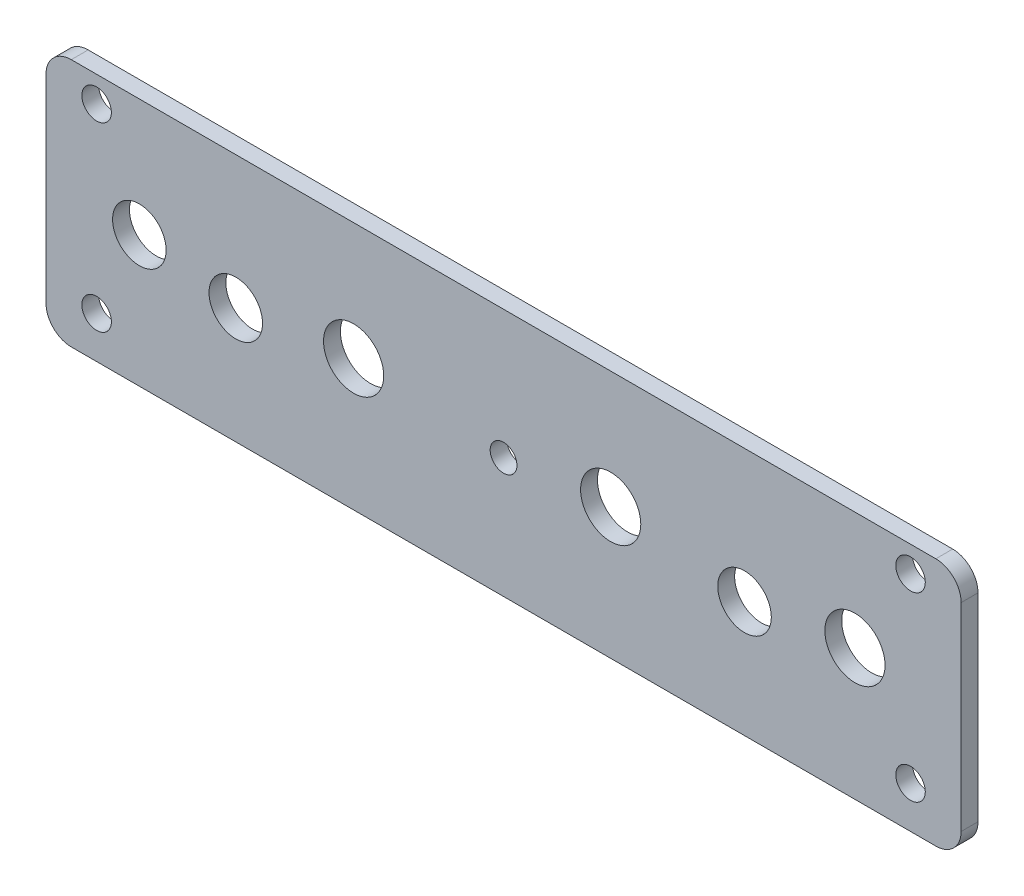
ISO-10303-21;
HEADER;
FILE_DESCRIPTION(('STEP AP214'),'2;1');
FILE_NAME('part.step','',(''),(''),'','','');
FILE_SCHEMA(('AUTOMOTIVE_DESIGN { 1 0 10303 214 1 1 1 1 }'));
ENDSEC;
DATA;
#1=APPLICATION_CONTEXT('core data for automotive mechanical design processes');
#2=APPLICATION_PROTOCOL_DEFINITION('international standard','automotive_design',2000,#1);
#3=PRODUCT_CONTEXT('',#1,'mechanical');
#4=PRODUCT('Part','Part','',(#3));
#5=PRODUCT_RELATED_PRODUCT_CATEGORY('part','',(#4));
#6=PRODUCT_DEFINITION_FORMATION('','',#4);
#7=PRODUCT_DEFINITION_CONTEXT('part definition',#1,'design');
#8=PRODUCT_DEFINITION('design','',#6,#7);
#9=PRODUCT_DEFINITION_SHAPE('','',#8);
#10=(LENGTH_UNIT() NAMED_UNIT(*) SI_UNIT(.MILLI.,.METRE.));
#11=(NAMED_UNIT(*) PLANE_ANGLE_UNIT() SI_UNIT($,.RADIAN.));
#12=(NAMED_UNIT(*) SI_UNIT($,.STERADIAN.) SOLID_ANGLE_UNIT());
#13=UNCERTAINTY_MEASURE_WITH_UNIT(LENGTH_MEASURE(1.E-05),#10,'distance_accuracy_value','');
#14=(GEOMETRIC_REPRESENTATION_CONTEXT(3) GLOBAL_UNCERTAINTY_ASSIGNED_CONTEXT((#13)) GLOBAL_UNIT_ASSIGNED_CONTEXT((#10,
#11,#12)) REPRESENTATION_CONTEXT('',''));
#15=CARTESIAN_POINT('',(0.,0.,0.));
#16=DIRECTION('',(0.,0.,1.));
#17=DIRECTION('',(1.,0.,0.));
#18=AXIS2_PLACEMENT_3D('',#15,#16,#17);
#19=CARTESIAN_POINT('',(51.25,-11.75,2.));
#20=DIRECTION('',(0.,0.,1.));
#21=DIRECTION('',(1.,0.,0.));
#22=AXIS2_PLACEMENT_3D('',#19,#20,#21);
#23=PLANE('',#22);
#24=CARTESIAN_POINT('',(-48.25,11.7,2.));
#25=DIRECTION('',(0.,0.,1.));
#26=DIRECTION('',(1.,0.,0.));
#27=AXIS2_PLACEMENT_3D('',#24,#25,#26);
#28=CIRCLE('',#27,1.75);
#29=CARTESIAN_POINT('',(-46.5,11.7,2.));
#30=VERTEX_POINT('',#29);
#31=EDGE_CURVE('E234',#30,#30,#28,.T.);
#32=ORIENTED_EDGE('',*,*,#31,.F.);
#33=EDGE_LOOP('',(#32));
#34=FACE_BOUND('',#33,.T.);
#35=CARTESIAN_POINT('',(48.25,11.7,2.));
#36=DIRECTION('',(0.,0.,1.));
#37=DIRECTION('',(1.,0.,0.));
#38=AXIS2_PLACEMENT_3D('',#35,#36,#37);
#39=CIRCLE('',#38,1.75);
#40=CARTESIAN_POINT('',(50.,11.7,2.));
#41=VERTEX_POINT('',#40);
#42=EDGE_CURVE('E222',#41,#41,#39,.T.);
#43=ORIENTED_EDGE('',*,*,#42,.F.);
#44=EDGE_LOOP('',(#43));
#45=FACE_BOUND('',#44,.T.);
#46=CARTESIAN_POINT('',(28.57,-1.,2.));
#47=DIRECTION('',(0.,0.,1.));
#48=DIRECTION('',(1.,0.,0.));
#49=AXIS2_PLACEMENT_3D('',#46,#47,#48);
#50=CIRCLE('',#49,3.175);
#51=CARTESIAN_POINT('',(31.745,-1.,2.));
#52=VERTEX_POINT('',#51);
#53=EDGE_CURVE('E210',#52,#52,#50,.T.);
#54=ORIENTED_EDGE('',*,*,#53,.F.);
#55=EDGE_LOOP('',(#54));
#56=FACE_BOUND('',#55,.T.);
#57=CARTESIAN_POINT('',(-43.18,0.8,2.));
#58=DIRECTION('',(0.,0.,1.));
#59=DIRECTION('',(1.,0.,0.));
#60=AXIS2_PLACEMENT_3D('',#57,#58,#59);
#61=CIRCLE('',#60,3.175);
#62=CARTESIAN_POINT('',(-40.005,0.8,2.));
#63=VERTEX_POINT('',#62);
#64=EDGE_CURVE('E198',#63,#63,#61,.T.);
#65=ORIENTED_EDGE('',*,*,#64,.F.);
#66=EDGE_LOOP('',(#65));
#67=FACE_BOUND('',#66,.T.);
#68=CARTESIAN_POINT('',(-17.78,0.8,2.));
#69=DIRECTION('',(0.,0.,1.));
#70=DIRECTION('',(1.,0.,0.));
#71=AXIS2_PLACEMENT_3D('',#68,#69,#70);
#72=CIRCLE('',#71,3.5687);
#73=CARTESIAN_POINT('',(-14.2113,0.8,2.));
#74=VERTEX_POINT('',#73);
#75=EDGE_CURVE('E186',#74,#74,#72,.T.);
#76=ORIENTED_EDGE('',*,*,#75,.F.);
#77=EDGE_LOOP('',(#76));
#78=FACE_BOUND('',#77,.T.);
#79=CARTESIAN_POINT('',(51.25,-11.75,2.));
#80=DIRECTION('',(0.,0.,1.));
#81=DIRECTION('',(1.,0.,0.));
#82=AXIS2_PLACEMENT_3D('',#79,#80,#81);
#83=CIRCLE('',#82,3.);
#84=CARTESIAN_POINT('',(51.25,-14.75,2.));
#85=VERTEX_POINT('',#84);
#86=CARTESIAN_POINT('',(54.25,-11.75,2.));
#87=VERTEX_POINT('',#86);
#88=EDGE_CURVE('E149',#85,#87,#83,.T.);
#89=ORIENTED_EDGE('',*,*,#88,.T.);
#90=DIRECTION('',(0.,1.,0.));
#91=VECTOR('',#90,1.);
#92=CARTESIAN_POINT('',(54.25,-11.75,2.));
#93=LINE('',#92,#91);
#94=CARTESIAN_POINT('',(54.25,11.75,2.));
#95=VERTEX_POINT('',#94);
#96=EDGE_CURVE('E97',#87,#95,#93,.T.);
#97=ORIENTED_EDGE('',*,*,#96,.T.);
#98=CARTESIAN_POINT('',(51.25,11.75,2.));
#99=DIRECTION('',(0.,0.,1.));
#100=DIRECTION('',(1.,0.,0.));
#101=AXIS2_PLACEMENT_3D('',#98,#99,#100);
#102=CIRCLE('',#101,3.);
#103=CARTESIAN_POINT('',(51.25,14.75,2.));
#104=VERTEX_POINT('',#103);
#105=EDGE_CURVE('E164',#95,#104,#102,.T.);
#106=ORIENTED_EDGE('',*,*,#105,.T.);
#107=DIRECTION('',(-1.,0.,0.));
#108=VECTOR('',#107,1.);
#109=CARTESIAN_POINT('',(51.25,14.75,2.));
#110=LINE('',#109,#108);
#111=CARTESIAN_POINT('',(-51.25,14.75,2.));
#112=VERTEX_POINT('',#111);
#113=EDGE_CURVE('E177',#104,#112,#110,.T.);
#114=ORIENTED_EDGE('',*,*,#113,.T.);
#115=CARTESIAN_POINT('',(-51.25,11.75,2.));
#116=DIRECTION('',(0.,0.,1.));
#117=DIRECTION('',(1.,0.,0.));
#118=AXIS2_PLACEMENT_3D('',#115,#116,#117);
#119=CIRCLE('',#118,3.);
#120=CARTESIAN_POINT('',(-54.25,11.75,2.));
#121=VERTEX_POINT('',#120);
#122=EDGE_CURVE('E116',#112,#121,#119,.T.);
#123=ORIENTED_EDGE('',*,*,#122,.T.);
#124=DIRECTION('',(0.,-1.,0.));
#125=VECTOR('',#124,1.);
#126=CARTESIAN_POINT('',(-54.25,-11.75,2.));
#127=LINE('',#126,#125);
#128=CARTESIAN_POINT('',(-54.25,-11.75,2.));
#129=VERTEX_POINT('',#128);
#130=EDGE_CURVE('E110',#121,#129,#127,.T.);
#131=ORIENTED_EDGE('',*,*,#130,.T.);
#132=CARTESIAN_POINT('',(-51.25,-11.75,2.));
#133=DIRECTION('',(0.,0.,1.));
#134=DIRECTION('',(-1.,0.,0.));
#135=AXIS2_PLACEMENT_3D('',#132,#133,#134);
#136=CIRCLE('',#135,3.);
#137=CARTESIAN_POINT('',(-51.25,-14.75,2.));
#138=VERTEX_POINT('',#137);
#139=EDGE_CURVE('E114',#129,#138,#136,.T.);
#140=ORIENTED_EDGE('',*,*,#139,.T.);
#141=DIRECTION('',(1.,0.,0.));
#142=VECTOR('',#141,1.);
#143=CARTESIAN_POINT('',(51.25,-14.75,2.));
#144=LINE('',#143,#142);
#145=EDGE_CURVE('E54',#138,#85,#144,.T.);
#146=ORIENTED_EDGE('',*,*,#145,.T.);
#147=EDGE_LOOP('',(#89,#97,#106,#114,#123,#131,#140,#146));
#148=FACE_BOUND('',#147,.T.);
#149=CARTESIAN_POINT('',(0.,-0.5,2.));
#150=DIRECTION('',(0.,0.,1.));
#151=DIRECTION('',(1.,0.,0.));
#152=AXIS2_PLACEMENT_3D('',#149,#150,#151);
#153=CIRCLE('',#152,1.5875);
#154=CARTESIAN_POINT('',(1.5875,-0.5,2.));
#155=VERTEX_POINT('',#154);
#156=EDGE_CURVE('E138',#155,#155,#153,.T.);
#157=ORIENTED_EDGE('',*,*,#156,.F.);
#158=EDGE_LOOP('',(#157));
#159=FACE_BOUND('',#158,.T.);
#160=CARTESIAN_POINT('',(-31.75,-1.,2.));
#161=DIRECTION('',(0.,0.,1.));
#162=DIRECTION('',(1.,0.,0.));
#163=AXIS2_PLACEMENT_3D('',#160,#161,#162);
#164=CIRCLE('',#163,3.175);
#165=CARTESIAN_POINT('',(-28.575,-1.,2.));
#166=VERTEX_POINT('',#165);
#167=EDGE_CURVE('E192',#166,#166,#164,.T.);
#168=ORIENTED_EDGE('',*,*,#167,.F.);
#169=EDGE_LOOP('',(#168));
#170=FACE_BOUND('',#169,.T.);
#171=CARTESIAN_POINT('',(12.7,0.8,2.));
#172=DIRECTION('',(0.,0.,1.));
#173=DIRECTION('',(1.,0.,0.));
#174=AXIS2_PLACEMENT_3D('',#171,#172,#173);
#175=CIRCLE('',#174,3.5687);
#176=CARTESIAN_POINT('',(16.2687,0.8,2.));
#177=VERTEX_POINT('',#176);
#178=EDGE_CURVE('E204',#177,#177,#175,.T.);
#179=ORIENTED_EDGE('',*,*,#178,.F.);
#180=EDGE_LOOP('',(#179));
#181=FACE_BOUND('',#180,.T.);
#182=CARTESIAN_POINT('',(41.66,0.8,2.));
#183=DIRECTION('',(0.,0.,1.));
#184=DIRECTION('',(1.,0.,0.));
#185=AXIS2_PLACEMENT_3D('',#182,#183,#184);
#186=CIRCLE('',#185,3.5687);
#187=CARTESIAN_POINT('',(45.2287,0.8,2.));
#188=VERTEX_POINT('',#187);
#189=EDGE_CURVE('E216',#188,#188,#186,.T.);
#190=ORIENTED_EDGE('',*,*,#189,.F.);
#191=EDGE_LOOP('',(#190));
#192=FACE_BOUND('',#191,.T.);
#193=CARTESIAN_POINT('',(48.25,-9.8,2.));
#194=DIRECTION('',(0.,0.,1.));
#195=DIRECTION('',(1.,0.,0.));
#196=AXIS2_PLACEMENT_3D('',#193,#194,#195);
#197=CIRCLE('',#196,1.75);
#198=CARTESIAN_POINT('',(50.,-9.8,2.));
#199=VERTEX_POINT('',#198);
#200=EDGE_CURVE('E228',#199,#199,#197,.T.);
#201=ORIENTED_EDGE('',*,*,#200,.F.);
#202=EDGE_LOOP('',(#201));
#203=FACE_BOUND('',#202,.T.);
#204=CARTESIAN_POINT('',(-48.25,-9.8,2.));
#205=DIRECTION('',(0.,0.,1.));
#206=DIRECTION('',(1.,0.,0.));
#207=AXIS2_PLACEMENT_3D('',#204,#205,#206);
#208=CIRCLE('',#207,1.75);
#209=CARTESIAN_POINT('',(-46.5,-9.8,2.));
#210=VERTEX_POINT('',#209);
#211=EDGE_CURVE('E240',#210,#210,#208,.T.);
#212=ORIENTED_EDGE('',*,*,#211,.F.);
#213=EDGE_LOOP('',(#212));
#214=FACE_BOUND('',#213,.T.);
#215=ADVANCED_FACE('F37',(#34,#45,#56,#67,#78,#148,#159,#170,#181,#192,#203,#214),#23,.T.);
#216=CARTESIAN_POINT('',(51.25,-11.75,0.));
#217=DIRECTION('',(0.,0.,1.));
#218=DIRECTION('',(1.,0.,0.));
#219=AXIS2_PLACEMENT_3D('',#216,#217,#218);
#220=PLANE('',#219);
#221=CARTESIAN_POINT('',(51.25,-11.75,0.));
#222=DIRECTION('',(0.,0.,1.));
#223=DIRECTION('',(1.,0.,0.));
#224=AXIS2_PLACEMENT_3D('',#221,#222,#223);
#225=CIRCLE('',#224,3.);
#226=CARTESIAN_POINT('',(51.25,-14.75,0.));
#227=VERTEX_POINT('',#226);
#228=CARTESIAN_POINT('',(54.25,-11.75,0.));
#229=VERTEX_POINT('',#228);
#230=EDGE_CURVE('E134',#227,#229,#225,.T.);
#231=ORIENTED_EDGE('',*,*,#230,.F.);
#232=DIRECTION('',(1.,0.,0.));
#233=VECTOR('',#232,1.);
#234=CARTESIAN_POINT('',(51.25,-14.75,0.));
#235=LINE('',#234,#233);
#236=CARTESIAN_POINT('',(-51.25,-14.75,0.));
#237=VERTEX_POINT('',#236);
#238=EDGE_CURVE('E89',#237,#227,#235,.T.);
#239=ORIENTED_EDGE('',*,*,#238,.F.);
#240=CARTESIAN_POINT('',(-51.25,-11.75,0.));
#241=DIRECTION('',(0.,0.,1.));
#242=DIRECTION('',(-1.,0.,0.));
#243=AXIS2_PLACEMENT_3D('',#240,#241,#242);
#244=CIRCLE('',#243,3.);
#245=CARTESIAN_POINT('',(-54.25,-11.75,0.));
#246=VERTEX_POINT('',#245);
#247=EDGE_CURVE('E83',#246,#237,#244,.T.);
#248=ORIENTED_EDGE('',*,*,#247,.F.);
#249=DIRECTION('',(0.,-1.,0.));
#250=VECTOR('',#249,1.);
#251=CARTESIAN_POINT('',(-54.25,-11.75,0.));
#252=LINE('',#251,#250);
#253=CARTESIAN_POINT('',(-54.25,11.75,0.));
#254=VERTEX_POINT('',#253);
#255=EDGE_CURVE('E124',#254,#246,#252,.T.);
#256=ORIENTED_EDGE('',*,*,#255,.F.);
#257=CARTESIAN_POINT('',(-51.25,11.75,0.));
#258=DIRECTION('',(0.,0.,1.));
#259=DIRECTION('',(1.,0.,0.));
#260=AXIS2_PLACEMENT_3D('',#257,#258,#259);
#261=CIRCLE('',#260,3.);
#262=CARTESIAN_POINT('',(-51.25,14.75,0.));
#263=VERTEX_POINT('',#262);
#264=EDGE_CURVE('E144',#263,#254,#261,.T.);
#265=ORIENTED_EDGE('',*,*,#264,.F.);
#266=DIRECTION('',(-1.,0.,0.));
#267=VECTOR('',#266,1.);
#268=CARTESIAN_POINT('',(51.25,14.75,0.));
#269=LINE('',#268,#267);
#270=CARTESIAN_POINT('',(51.25,14.75,0.));
#271=VERTEX_POINT('',#270);
#272=EDGE_CURVE('E142',#271,#263,#269,.T.);
#273=ORIENTED_EDGE('',*,*,#272,.F.);
#274=CARTESIAN_POINT('',(51.25,11.75,0.));
#275=DIRECTION('',(0.,0.,1.));
#276=DIRECTION('',(1.,0.,0.));
#277=AXIS2_PLACEMENT_3D('',#274,#275,#276);
#278=CIRCLE('',#277,3.);
#279=CARTESIAN_POINT('',(54.25,11.75,0.));
#280=VERTEX_POINT('',#279);
#281=EDGE_CURVE('E140',#280,#271,#278,.T.);
#282=ORIENTED_EDGE('',*,*,#281,.F.);
#283=DIRECTION('',(0.,1.,0.));
#284=VECTOR('',#283,1.);
#285=CARTESIAN_POINT('',(54.25,-11.75,0.));
#286=LINE('',#285,#284);
#287=EDGE_CURVE('E137',#229,#280,#286,.T.);
#288=ORIENTED_EDGE('',*,*,#287,.F.);
#289=EDGE_LOOP('',(#231,#239,#248,#256,#265,#273,#282,#288));
#290=FACE_BOUND('',#289,.T.);
#291=CARTESIAN_POINT('',(0.,-0.5,0.));
#292=DIRECTION('',(0.,0.,1.));
#293=DIRECTION('',(1.,0.,0.));
#294=AXIS2_PLACEMENT_3D('',#291,#292,#293);
#295=CIRCLE('',#294,1.5875);
#296=CARTESIAN_POINT('',(1.5875,-0.5,0.));
#297=VERTEX_POINT('',#296);
#298=EDGE_CURVE('E183',#297,#297,#295,.T.);
#299=ORIENTED_EDGE('',*,*,#298,.T.);
#300=EDGE_LOOP('',(#299));
#301=FACE_BOUND('',#300,.T.);
#302=CARTESIAN_POINT('',(-17.78,0.8,0.));
#303=DIRECTION('',(0.,0.,1.));
#304=DIRECTION('',(1.,0.,0.));
#305=AXIS2_PLACEMENT_3D('',#302,#303,#304);
#306=CIRCLE('',#305,3.5687);
#307=CARTESIAN_POINT('',(-14.2113,0.8,0.));
#308=VERTEX_POINT('',#307);
#309=EDGE_CURVE('E189',#308,#308,#306,.T.);
#310=ORIENTED_EDGE('',*,*,#309,.T.);
#311=EDGE_LOOP('',(#310));
#312=FACE_BOUND('',#311,.T.);
#313=CARTESIAN_POINT('',(-31.75,-1.,0.));
#314=DIRECTION('',(0.,0.,1.));
#315=DIRECTION('',(1.,0.,0.));
#316=AXIS2_PLACEMENT_3D('',#313,#314,#315);
#317=CIRCLE('',#316,3.175);
#318=CARTESIAN_POINT('',(-28.575,-1.,0.));
#319=VERTEX_POINT('',#318);
#320=EDGE_CURVE('E195',#319,#319,#317,.T.);
#321=ORIENTED_EDGE('',*,*,#320,.T.);
#322=EDGE_LOOP('',(#321));
#323=FACE_BOUND('',#322,.T.);
#324=CARTESIAN_POINT('',(-43.18,0.8,0.));
#325=DIRECTION('',(0.,0.,1.));
#326=DIRECTION('',(1.,0.,0.));
#327=AXIS2_PLACEMENT_3D('',#324,#325,#326);
#328=CIRCLE('',#327,3.175);
#329=CARTESIAN_POINT('',(-40.005,0.8,0.));
#330=VERTEX_POINT('',#329);
#331=EDGE_CURVE('E201',#330,#330,#328,.T.);
#332=ORIENTED_EDGE('',*,*,#331,.T.);
#333=EDGE_LOOP('',(#332));
#334=FACE_BOUND('',#333,.T.);
#335=CARTESIAN_POINT('',(12.7,0.8,0.));
#336=DIRECTION('',(0.,0.,1.));
#337=DIRECTION('',(1.,0.,0.));
#338=AXIS2_PLACEMENT_3D('',#335,#336,#337);
#339=CIRCLE('',#338,3.5687);
#340=CARTESIAN_POINT('',(16.2687,0.8,0.));
#341=VERTEX_POINT('',#340);
#342=EDGE_CURVE('E207',#341,#341,#339,.T.);
#343=ORIENTED_EDGE('',*,*,#342,.T.);
#344=EDGE_LOOP('',(#343));
#345=FACE_BOUND('',#344,.T.);
#346=CARTESIAN_POINT('',(28.57,-1.,0.));
#347=DIRECTION('',(0.,0.,1.));
#348=DIRECTION('',(1.,0.,0.));
#349=AXIS2_PLACEMENT_3D('',#346,#347,#348);
#350=CIRCLE('',#349,3.175);
#351=CARTESIAN_POINT('',(31.745,-1.,0.));
#352=VERTEX_POINT('',#351);
#353=EDGE_CURVE('E213',#352,#352,#350,.T.);
#354=ORIENTED_EDGE('',*,*,#353,.T.);
#355=EDGE_LOOP('',(#354));
#356=FACE_BOUND('',#355,.T.);
#357=CARTESIAN_POINT('',(41.66,0.8,0.));
#358=DIRECTION('',(0.,0.,1.));
#359=DIRECTION('',(1.,0.,0.));
#360=AXIS2_PLACEMENT_3D('',#357,#358,#359);
#361=CIRCLE('',#360,3.5687);
#362=CARTESIAN_POINT('',(45.2287,0.8,0.));
#363=VERTEX_POINT('',#362);
#364=EDGE_CURVE('E219',#363,#363,#361,.T.);
#365=ORIENTED_EDGE('',*,*,#364,.T.);
#366=EDGE_LOOP('',(#365));
#367=FACE_BOUND('',#366,.T.);
#368=CARTESIAN_POINT('',(48.25,11.7,0.));
#369=DIRECTION('',(0.,0.,1.));
#370=DIRECTION('',(1.,0.,0.));
#371=AXIS2_PLACEMENT_3D('',#368,#369,#370);
#372=CIRCLE('',#371,1.75);
#373=CARTESIAN_POINT('',(50.,11.7,0.));
#374=VERTEX_POINT('',#373);
#375=EDGE_CURVE('E225',#374,#374,#372,.T.);
#376=ORIENTED_EDGE('',*,*,#375,.T.);
#377=EDGE_LOOP('',(#376));
#378=FACE_BOUND('',#377,.T.);
#379=CARTESIAN_POINT('',(48.25,-9.8,0.));
#380=DIRECTION('',(0.,0.,1.));
#381=DIRECTION('',(1.,0.,0.));
#382=AXIS2_PLACEMENT_3D('',#379,#380,#381);
#383=CIRCLE('',#382,1.75);
#384=CARTESIAN_POINT('',(50.,-9.8,0.));
#385=VERTEX_POINT('',#384);
#386=EDGE_CURVE('E231',#385,#385,#383,.T.);
#387=ORIENTED_EDGE('',*,*,#386,.T.);
#388=EDGE_LOOP('',(#387));
#389=FACE_BOUND('',#388,.T.);
#390=CARTESIAN_POINT('',(-48.25,11.7,0.));
#391=DIRECTION('',(0.,0.,1.));
#392=DIRECTION('',(1.,0.,0.));
#393=AXIS2_PLACEMENT_3D('',#390,#391,#392);
#394=CIRCLE('',#393,1.75);
#395=CARTESIAN_POINT('',(-46.5,11.7,0.));
#396=VERTEX_POINT('',#395);
#397=EDGE_CURVE('E237',#396,#396,#394,.T.);
#398=ORIENTED_EDGE('',*,*,#397,.T.);
#399=EDGE_LOOP('',(#398));
#400=FACE_BOUND('',#399,.T.);
#401=CARTESIAN_POINT('',(-48.25,-9.8,0.));
#402=DIRECTION('',(0.,0.,1.));
#403=DIRECTION('',(1.,0.,0.));
#404=AXIS2_PLACEMENT_3D('',#401,#402,#403);
#405=CIRCLE('',#404,1.75);
#406=CARTESIAN_POINT('',(-46.5,-9.8,0.));
#407=VERTEX_POINT('',#406);
#408=EDGE_CURVE('E243',#407,#407,#405,.T.);
#409=ORIENTED_EDGE('',*,*,#408,.T.);
#410=EDGE_LOOP('',(#409));
#411=FACE_BOUND('',#410,.T.);
#412=ADVANCED_FACE('F168',(#290,#301,#312,#323,#334,#345,#356,#367,#378,#389,#400,#411),#220,.F.);
#413=CARTESIAN_POINT('',(51.25,-11.75,2.));
#414=DIRECTION('',(0.,0.,-1.));
#415=DIRECTION('',(-1.,0.,0.));
#416=AXIS2_PLACEMENT_3D('',#413,#414,#415);
#417=CYLINDRICAL_SURFACE('',#416,3.);
#418=ORIENTED_EDGE('',*,*,#230,.T.);
#419=DIRECTION('',(0.,0.,-1.));
#420=VECTOR('',#419,1.);
#421=CARTESIAN_POINT('',(54.25,-11.75,2.));
#422=LINE('',#421,#420);
#423=EDGE_CURVE('E11',#87,#229,#422,.T.);
#424=ORIENTED_EDGE('',*,*,#423,.F.);
#425=ORIENTED_EDGE('',*,*,#88,.F.);
#426=DIRECTION('',(0.,0.,-1.));
#427=VECTOR('',#426,1.);
#428=CARTESIAN_POINT('',(51.25,-14.75,2.));
#429=LINE('',#428,#427);
#430=EDGE_CURVE('E130',#85,#227,#429,.T.);
#431=ORIENTED_EDGE('',*,*,#430,.T.);
#432=EDGE_LOOP('',(#418,#424,#425,#431));
#433=FACE_BOUND('',#432,.T.);
#434=ADVANCED_FACE('F39',(#433),#417,.T.);
#435=CARTESIAN_POINT('',(54.25,-11.75,2.));
#436=DIRECTION('',(-1.,0.,0.));
#437=DIRECTION('',(0.,0.,1.));
#438=AXIS2_PLACEMENT_3D('',#435,#436,#437);
#439=PLANE('',#438);
#440=ORIENTED_EDGE('',*,*,#287,.T.);
#441=DIRECTION('',(0.,0.,-1.));
#442=VECTOR('',#441,1.);
#443=CARTESIAN_POINT('',(54.25,11.75,2.));
#444=LINE('',#443,#442);
#445=EDGE_CURVE('E46',#95,#280,#444,.T.);
#446=ORIENTED_EDGE('',*,*,#445,.F.);
#447=ORIENTED_EDGE('',*,*,#96,.F.);
#448=ORIENTED_EDGE('',*,*,#423,.T.);
#449=EDGE_LOOP('',(#440,#446,#447,#448));
#450=FACE_BOUND('',#449,.T.);
#451=ADVANCED_FACE('F277',(#450),#439,.F.);
#452=CARTESIAN_POINT('',(51.25,11.75,2.));
#453=DIRECTION('',(0.,0.,-1.));
#454=DIRECTION('',(-1.,0.,0.));
#455=AXIS2_PLACEMENT_3D('',#452,#453,#454);
#456=CYLINDRICAL_SURFACE('',#455,3.);
#457=ORIENTED_EDGE('',*,*,#281,.T.);
#458=DIRECTION('',(0.,0.,-1.));
#459=VECTOR('',#458,1.);
#460=CARTESIAN_POINT('',(51.25,14.75,2.));
#461=LINE('',#460,#459);
#462=EDGE_CURVE('E156',#104,#271,#461,.T.);
#463=ORIENTED_EDGE('',*,*,#462,.F.);
#464=ORIENTED_EDGE('',*,*,#105,.F.);
#465=ORIENTED_EDGE('',*,*,#445,.T.);
#466=EDGE_LOOP('',(#457,#463,#464,#465));
#467=FACE_BOUND('',#466,.T.);
#468=ADVANCED_FACE('F162',(#467),#456,.T.);
#469=CARTESIAN_POINT('',(51.25,14.75,2.));
#470=DIRECTION('',(0.,-1.,0.));
#471=DIRECTION('',(1.,0.,0.));
#472=AXIS2_PLACEMENT_3D('',#469,#470,#471);
#473=PLANE('',#472);
#474=ORIENTED_EDGE('',*,*,#272,.T.);
#475=DIRECTION('',(0.,0.,-1.));
#476=VECTOR('',#475,1.);
#477=CARTESIAN_POINT('',(-51.25,14.75,2.));
#478=LINE('',#477,#476);
#479=EDGE_CURVE('E153',#112,#263,#478,.T.);
#480=ORIENTED_EDGE('',*,*,#479,.F.);
#481=ORIENTED_EDGE('',*,*,#113,.F.);
#482=ORIENTED_EDGE('',*,*,#462,.T.);
#483=EDGE_LOOP('',(#474,#480,#481,#482));
#484=FACE_BOUND('',#483,.T.);
#485=ADVANCED_FACE('F173',(#484),#473,.F.);
#486=CARTESIAN_POINT('',(-51.25,11.75,2.));
#487=DIRECTION('',(0.,0.,-1.));
#488=DIRECTION('',(-1.,0.,0.));
#489=AXIS2_PLACEMENT_3D('',#486,#487,#488);
#490=CYLINDRICAL_SURFACE('',#489,3.);
#491=ORIENTED_EDGE('',*,*,#264,.T.);
#492=DIRECTION('',(0.,0.,-1.));
#493=VECTOR('',#492,1.);
#494=CARTESIAN_POINT('',(-54.25,11.75,2.));
#495=LINE('',#494,#493);
#496=EDGE_CURVE('E125',#121,#254,#495,.T.);
#497=ORIENTED_EDGE('',*,*,#496,.F.);
#498=ORIENTED_EDGE('',*,*,#122,.F.);
#499=ORIENTED_EDGE('',*,*,#479,.T.);
#500=EDGE_LOOP('',(#491,#497,#498,#499));
#501=FACE_BOUND('',#500,.T.);
#502=ADVANCED_FACE('F176',(#501),#490,.T.);
#503=CARTESIAN_POINT('',(-54.25,-11.75,2.));
#504=DIRECTION('',(1.,0.,0.));
#505=DIRECTION('',(0.,0.,-1.));
#506=AXIS2_PLACEMENT_3D('',#503,#504,#505);
#507=PLANE('',#506);
#508=ORIENTED_EDGE('',*,*,#255,.T.);
#509=DIRECTION('',(0.,0.,-1.));
#510=VECTOR('',#509,1.);
#511=CARTESIAN_POINT('',(-54.25,-11.75,2.));
#512=LINE('',#511,#510);
#513=EDGE_CURVE('E121',#129,#246,#512,.T.);
#514=ORIENTED_EDGE('',*,*,#513,.F.);
#515=ORIENTED_EDGE('',*,*,#130,.F.);
#516=ORIENTED_EDGE('',*,*,#496,.T.);
#517=EDGE_LOOP('',(#508,#514,#515,#516));
#518=FACE_BOUND('',#517,.T.);
#519=ADVANCED_FACE('F122',(#518),#507,.F.);
#520=CARTESIAN_POINT('',(-51.25,-11.75,2.));
#521=DIRECTION('',(0.,0.,-1.));
#522=DIRECTION('',(-1.,0.,0.));
#523=AXIS2_PLACEMENT_3D('',#520,#521,#522);
#524=CYLINDRICAL_SURFACE('',#523,3.);
#525=ORIENTED_EDGE('',*,*,#247,.T.);
#526=DIRECTION('',(0.,0.,-1.));
#527=VECTOR('',#526,1.);
#528=CARTESIAN_POINT('',(-51.25,-14.75,2.));
#529=LINE('',#528,#527);
#530=EDGE_CURVE('E126',#138,#237,#529,.T.);
#531=ORIENTED_EDGE('',*,*,#530,.F.);
#532=ORIENTED_EDGE('',*,*,#139,.F.);
#533=ORIENTED_EDGE('',*,*,#513,.T.);
#534=EDGE_LOOP('',(#525,#531,#532,#533));
#535=FACE_BOUND('',#534,.T.);
#536=ADVANCED_FACE('F128',(#535),#524,.T.);
#537=CARTESIAN_POINT('',(51.25,-14.75,2.));
#538=DIRECTION('',(0.,1.,0.));
#539=DIRECTION('',(-1.,0.,0.));
#540=AXIS2_PLACEMENT_3D('',#537,#538,#539);
#541=PLANE('',#540);
#542=ORIENTED_EDGE('',*,*,#238,.T.);
#543=ORIENTED_EDGE('',*,*,#430,.F.);
#544=ORIENTED_EDGE('',*,*,#145,.F.);
#545=ORIENTED_EDGE('',*,*,#530,.T.);
#546=EDGE_LOOP('',(#542,#543,#544,#545));
#547=FACE_BOUND('',#546,.T.);
#548=ADVANCED_FACE('F265',(#547),#541,.F.);
#549=CARTESIAN_POINT('',(0.,-0.5,2.));
#550=DIRECTION('',(0.,0.,-1.));
#551=DIRECTION('',(-1.,0.,0.));
#552=AXIS2_PLACEMENT_3D('',#549,#550,#551);
#553=CYLINDRICAL_SURFACE('',#552,1.5875);
#554=ORIENTED_EDGE('',*,*,#156,.T.);
#555=EDGE_LOOP('',(#554));
#556=FACE_BOUND('',#555,.T.);
#557=ORIENTED_EDGE('',*,*,#298,.F.);
#558=EDGE_LOOP('',(#557));
#559=FACE_BOUND('',#558,.T.);
#560=ADVANCED_FACE('F262',(#556,#559),#553,.F.);
#561=CARTESIAN_POINT('',(-17.78,0.8,2.));
#562=DIRECTION('',(0.,0.,-1.));
#563=DIRECTION('',(-1.,0.,0.));
#564=AXIS2_PLACEMENT_3D('',#561,#562,#563);
#565=CYLINDRICAL_SURFACE('',#564,3.5687);
#566=ORIENTED_EDGE('',*,*,#75,.T.);
#567=EDGE_LOOP('',(#566));
#568=FACE_BOUND('',#567,.T.);
#569=ORIENTED_EDGE('',*,*,#309,.F.);
#570=EDGE_LOOP('',(#569));
#571=FACE_BOUND('',#570,.T.);
#572=ADVANCED_FACE('F341',(#568,#571),#565,.F.);
#573=CARTESIAN_POINT('',(-31.75,-1.,2.));
#574=DIRECTION('',(0.,0.,-1.));
#575=DIRECTION('',(-1.,0.,0.));
#576=AXIS2_PLACEMENT_3D('',#573,#574,#575);
#577=CYLINDRICAL_SURFACE('',#576,3.175);
#578=ORIENTED_EDGE('',*,*,#167,.T.);
#579=EDGE_LOOP('',(#578));
#580=FACE_BOUND('',#579,.T.);
#581=ORIENTED_EDGE('',*,*,#320,.F.);
#582=EDGE_LOOP('',(#581));
#583=FACE_BOUND('',#582,.T.);
#584=ADVANCED_FACE('F349',(#580,#583),#577,.F.);
#585=CARTESIAN_POINT('',(-43.18,0.8,2.));
#586=DIRECTION('',(0.,0.,-1.));
#587=DIRECTION('',(-1.,0.,0.));
#588=AXIS2_PLACEMENT_3D('',#585,#586,#587);
#589=CYLINDRICAL_SURFACE('',#588,3.175);
#590=ORIENTED_EDGE('',*,*,#64,.T.);
#591=EDGE_LOOP('',(#590));
#592=FACE_BOUND('',#591,.T.);
#593=ORIENTED_EDGE('',*,*,#331,.F.);
#594=EDGE_LOOP('',(#593));
#595=FACE_BOUND('',#594,.T.);
#596=ADVANCED_FACE('F357',(#592,#595),#589,.F.);
#597=CARTESIAN_POINT('',(12.7,0.8,2.));
#598=DIRECTION('',(0.,0.,-1.));
#599=DIRECTION('',(-1.,0.,0.));
#600=AXIS2_PLACEMENT_3D('',#597,#598,#599);
#601=CYLINDRICAL_SURFACE('',#600,3.5687);
#602=ORIENTED_EDGE('',*,*,#178,.T.);
#603=EDGE_LOOP('',(#602));
#604=FACE_BOUND('',#603,.T.);
#605=ORIENTED_EDGE('',*,*,#342,.F.);
#606=EDGE_LOOP('',(#605));
#607=FACE_BOUND('',#606,.T.);
#608=ADVANCED_FACE('F366',(#604,#607),#601,.F.);
#609=CARTESIAN_POINT('',(28.57,-1.,2.));
#610=DIRECTION('',(0.,0.,-1.));
#611=DIRECTION('',(-1.,0.,0.));
#612=AXIS2_PLACEMENT_3D('',#609,#610,#611);
#613=CYLINDRICAL_SURFACE('',#612,3.175);
#614=ORIENTED_EDGE('',*,*,#53,.T.);
#615=EDGE_LOOP('',(#614));
#616=FACE_BOUND('',#615,.T.);
#617=ORIENTED_EDGE('',*,*,#353,.F.);
#618=EDGE_LOOP('',(#617));
#619=FACE_BOUND('',#618,.T.);
#620=ADVANCED_FACE('F375',(#616,#619),#613,.F.);
#621=CARTESIAN_POINT('',(41.66,0.8,2.));
#622=DIRECTION('',(0.,0.,-1.));
#623=DIRECTION('',(-1.,0.,0.));
#624=AXIS2_PLACEMENT_3D('',#621,#622,#623);
#625=CYLINDRICAL_SURFACE('',#624,3.5687);
#626=ORIENTED_EDGE('',*,*,#189,.T.);
#627=EDGE_LOOP('',(#626));
#628=FACE_BOUND('',#627,.T.);
#629=ORIENTED_EDGE('',*,*,#364,.F.);
#630=EDGE_LOOP('',(#629));
#631=FACE_BOUND('',#630,.T.);
#632=ADVANCED_FACE('F384',(#628,#631),#625,.F.);
#633=CARTESIAN_POINT('',(48.25,11.7,2.));
#634=DIRECTION('',(0.,0.,-1.));
#635=DIRECTION('',(-1.,0.,0.));
#636=AXIS2_PLACEMENT_3D('',#633,#634,#635);
#637=CYLINDRICAL_SURFACE('',#636,1.75);
#638=ORIENTED_EDGE('',*,*,#42,.T.);
#639=EDGE_LOOP('',(#638));
#640=FACE_BOUND('',#639,.T.);
#641=ORIENTED_EDGE('',*,*,#375,.F.);
#642=EDGE_LOOP('',(#641));
#643=FACE_BOUND('',#642,.T.);
#644=ADVANCED_FACE('F393',(#640,#643),#637,.F.);
#645=CARTESIAN_POINT('',(48.25,-9.8,2.));
#646=DIRECTION('',(0.,0.,-1.));
#647=DIRECTION('',(-1.,0.,0.));
#648=AXIS2_PLACEMENT_3D('',#645,#646,#647);
#649=CYLINDRICAL_SURFACE('',#648,1.75);
#650=ORIENTED_EDGE('',*,*,#200,.T.);
#651=EDGE_LOOP('',(#650));
#652=FACE_BOUND('',#651,.T.);
#653=ORIENTED_EDGE('',*,*,#386,.F.);
#654=EDGE_LOOP('',(#653));
#655=FACE_BOUND('',#654,.T.);
#656=ADVANCED_FACE('F402',(#652,#655),#649,.F.);
#657=CARTESIAN_POINT('',(-48.25,11.7,2.));
#658=DIRECTION('',(0.,0.,-1.));
#659=DIRECTION('',(-1.,0.,0.));
#660=AXIS2_PLACEMENT_3D('',#657,#658,#659);
#661=CYLINDRICAL_SURFACE('',#660,1.75);
#662=ORIENTED_EDGE('',*,*,#31,.T.);
#663=EDGE_LOOP('',(#662));
#664=FACE_BOUND('',#663,.T.);
#665=ORIENTED_EDGE('',*,*,#397,.F.);
#666=EDGE_LOOP('',(#665));
#667=FACE_BOUND('',#666,.T.);
#668=ADVANCED_FACE('F411',(#664,#667),#661,.F.);
#669=CARTESIAN_POINT('',(-48.25,-9.8,2.));
#670=DIRECTION('',(0.,0.,-1.));
#671=DIRECTION('',(-1.,0.,0.));
#672=AXIS2_PLACEMENT_3D('',#669,#670,#671);
#673=CYLINDRICAL_SURFACE('',#672,1.75);
#674=ORIENTED_EDGE('',*,*,#211,.T.);
#675=EDGE_LOOP('',(#674));
#676=FACE_BOUND('',#675,.T.);
#677=ORIENTED_EDGE('',*,*,#408,.F.);
#678=EDGE_LOOP('',(#677));
#679=FACE_BOUND('',#678,.T.);
#680=ADVANCED_FACE('F249',(#676,#679),#673,.F.);
#681=CLOSED_SHELL('',(#215,#412,#434,#451,#468,#485,#502,#519,#536,#548,#560,#572,#584,#596,
#608,#620,#632,#644,#656,#668,#680));
#682=MANIFOLD_SOLID_BREP('B2',#681);
#683=ADVANCED_BREP_SHAPE_REPRESENTATION('',(#18,#682),#14);
#684=SHAPE_DEFINITION_REPRESENTATION(#9,#683);
ENDSEC;
END-ISO-10303-21;
